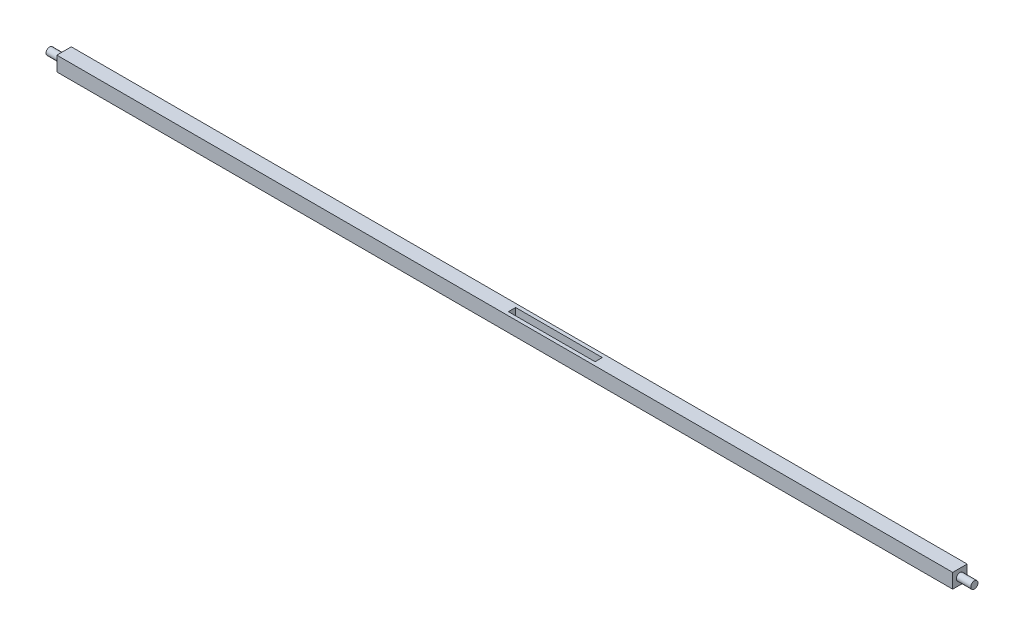
ISO-10303-21;
HEADER;
FILE_DESCRIPTION(('STEP AP214'),'2;1');
FILE_NAME('part.step','',(''),(''),'','','');
FILE_SCHEMA(('AUTOMOTIVE_DESIGN { 1 0 10303 214 1 1 1 1 }'));
ENDSEC;
DATA;
#1=APPLICATION_CONTEXT('core data for automotive mechanical design processes');
#2=APPLICATION_PROTOCOL_DEFINITION('international standard','automotive_design',2000,#1);
#3=PRODUCT_CONTEXT('',#1,'mechanical');
#4=PRODUCT('Part','Part','',(#3));
#5=PRODUCT_RELATED_PRODUCT_CATEGORY('part','',(#4));
#6=PRODUCT_DEFINITION_FORMATION('','',#4);
#7=PRODUCT_DEFINITION_CONTEXT('part definition',#1,'design');
#8=PRODUCT_DEFINITION('design','',#6,#7);
#9=PRODUCT_DEFINITION_SHAPE('','',#8);
#10=(LENGTH_UNIT() NAMED_UNIT(*) SI_UNIT(.MILLI.,.METRE.));
#11=(NAMED_UNIT(*) PLANE_ANGLE_UNIT() SI_UNIT($,.RADIAN.));
#12=(NAMED_UNIT(*) SI_UNIT($,.STERADIAN.) SOLID_ANGLE_UNIT());
#13=UNCERTAINTY_MEASURE_WITH_UNIT(LENGTH_MEASURE(1.E-05),#10,'distance_accuracy_value','');
#14=(GEOMETRIC_REPRESENTATION_CONTEXT(3) GLOBAL_UNCERTAINTY_ASSIGNED_CONTEXT((#13)) GLOBAL_UNIT_ASSIGNED_CONTEXT((#10,
#11,#12)) REPRESENTATION_CONTEXT('',''));
#15=CARTESIAN_POINT('',(0.,0.,0.));
#16=DIRECTION('',(0.,0.,1.));
#17=DIRECTION('',(1.,0.,0.));
#18=AXIS2_PLACEMENT_3D('',#15,#16,#17);
#19=CARTESIAN_POINT('',(406.4,-6.41066878980892,-6.35));
#20=DIRECTION('',(0.,0.,1.));
#21=DIRECTION('',(1.,0.,0.));
#22=AXIS2_PLACEMENT_3D('',#19,#20,#21);
#23=PLANE('',#22);
#24=DIRECTION('',(0.,1.,0.));
#25=VECTOR('',#24,1.);
#26=CARTESIAN_POINT('',(-393.7,0.,-6.35));
#27=LINE('',#26,#25);
#28=CARTESIAN_POINT('',(-393.7,-6.41066878980892,-6.35));
#29=VERTEX_POINT('',#28);
#30=CARTESIAN_POINT('',(-393.7,6.41066878980892,-6.35));
#31=VERTEX_POINT('',#30);
#32=EDGE_CURVE('E205',#29,#31,#27,.T.);
#33=ORIENTED_EDGE('',*,*,#32,.T.);
#34=DIRECTION('',(-1.,0.,0.));
#35=VECTOR('',#34,1.);
#36=CARTESIAN_POINT('',(406.4,6.41066878980892,-6.35));
#37=LINE('',#36,#35);
#38=CARTESIAN_POINT('',(393.7,6.41066878980892,-6.35));
#39=VERTEX_POINT('',#38);
#40=EDGE_CURVE('E12',#39,#31,#37,.T.);
#41=ORIENTED_EDGE('',*,*,#40,.F.);
#42=DIRECTION('',(0.,1.,0.));
#43=VECTOR('',#42,1.);
#44=CARTESIAN_POINT('',(393.7,0.,-6.35));
#45=LINE('',#44,#43);
#46=CARTESIAN_POINT('',(393.7,-6.41066878980892,-6.35));
#47=VERTEX_POINT('',#46);
#48=EDGE_CURVE('E216',#47,#39,#45,.T.);
#49=ORIENTED_EDGE('',*,*,#48,.F.);
#50=DIRECTION('',(-1.,0.,0.));
#51=VECTOR('',#50,1.);
#52=CARTESIAN_POINT('',(406.4,-6.41066878980892,-6.35));
#53=LINE('',#52,#51);
#54=EDGE_CURVE('E224',#47,#29,#53,.T.);
#55=ORIENTED_EDGE('',*,*,#54,.T.);
#56=EDGE_LOOP('',(#33,#41,#49,#55));
#57=FACE_BOUND('',#56,.T.);
#58=ADVANCED_FACE('F94',(#57),#23,.F.);
#59=CARTESIAN_POINT('',(406.4,6.41066878980892,6.35));
#60=DIRECTION('',(0.,-1.,0.));
#61=DIRECTION('',(0.,0.,-1.));
#62=AXIS2_PLACEMENT_3D('',#59,#60,#61);
#63=PLANE('',#62);
#64=DIRECTION('',(1.,0.,0.));
#65=VECTOR('',#64,1.);
#66=CARTESIAN_POINT('',(0.,6.41066878980892,3.175));
#67=LINE('',#66,#65);
#68=CARTESIAN_POINT('',(0.,6.41066878980892,3.175));
#69=VERTEX_POINT('',#68);
#70=CARTESIAN_POINT('',(76.2,6.41066878980892,3.175));
#71=VERTEX_POINT('',#70);
#72=EDGE_CURVE('E180',#69,#71,#67,.T.);
#73=ORIENTED_EDGE('',*,*,#72,.F.);
#74=DIRECTION('',(0.,0.,1.));
#75=VECTOR('',#74,1.);
#76=CARTESIAN_POINT('',(0.,6.41066878980892,-3.175));
#77=LINE('',#76,#75);
#78=CARTESIAN_POINT('',(0.,6.41066878980892,-3.175));
#79=VERTEX_POINT('',#78);
#80=EDGE_CURVE('E108',#79,#69,#77,.T.);
#81=ORIENTED_EDGE('',*,*,#80,.F.);
#82=DIRECTION('',(-1.,0.,0.));
#83=VECTOR('',#82,1.);
#84=CARTESIAN_POINT('',(0.,6.41066878980892,-3.175));
#85=LINE('',#84,#83);
#86=CARTESIAN_POINT('',(76.2,6.41066878980892,-3.175));
#87=VERTEX_POINT('',#86);
#88=EDGE_CURVE('E166',#87,#79,#85,.T.);
#89=ORIENTED_EDGE('',*,*,#88,.F.);
#90=DIRECTION('',(0.,0.,-1.));
#91=VECTOR('',#90,1.);
#92=CARTESIAN_POINT('',(76.2,6.41066878980892,-3.175));
#93=LINE('',#92,#91);
#94=EDGE_CURVE('E186',#71,#87,#93,.T.);
#95=ORIENTED_EDGE('',*,*,#94,.F.);
#96=EDGE_LOOP('',(#73,#81,#89,#95));
#97=FACE_BOUND('',#96,.T.);
#98=DIRECTION('',(0.,0.,1.));
#99=VECTOR('',#98,1.);
#100=CARTESIAN_POINT('',(-393.7,6.41066878980892,0.));
#101=LINE('',#100,#99);
#102=CARTESIAN_POINT('',(-393.7,6.41066878980892,6.35));
#103=VERTEX_POINT('',#102);
#104=EDGE_CURVE('E202',#31,#103,#101,.T.);
#105=ORIENTED_EDGE('',*,*,#104,.T.);
#106=DIRECTION('',(-1.,0.,0.));
#107=VECTOR('',#106,1.);
#108=CARTESIAN_POINT('',(406.4,6.41066878980892,6.35));
#109=LINE('',#108,#107);
#110=CARTESIAN_POINT('',(393.7,6.41066878980892,6.35));
#111=VERTEX_POINT('',#110);
#112=EDGE_CURVE('E101',#111,#103,#109,.T.);
#113=ORIENTED_EDGE('',*,*,#112,.F.);
#114=DIRECTION('',(0.,0.,-1.));
#115=VECTOR('',#114,1.);
#116=CARTESIAN_POINT('',(393.7,6.41066878980892,0.));
#117=LINE('',#116,#115);
#118=EDGE_CURVE('E218',#111,#39,#117,.T.);
#119=ORIENTED_EDGE('',*,*,#118,.T.);
#120=ORIENTED_EDGE('',*,*,#40,.T.);
#121=EDGE_LOOP('',(#105,#113,#119,#120));
#122=FACE_BOUND('',#121,.T.);
#123=ADVANCED_FACE('F238',(#97,#122),#63,.F.);
#124=CARTESIAN_POINT('',(406.4,-6.41066878980892,6.35));
#125=DIRECTION('',(0.,0.,-1.));
#126=DIRECTION('',(-1.,0.,0.));
#127=AXIS2_PLACEMENT_3D('',#124,#125,#126);
#128=PLANE('',#127);
#129=DIRECTION('',(0.,1.,0.));
#130=VECTOR('',#129,1.);
#131=CARTESIAN_POINT('',(-393.7,0.,6.35));
#132=LINE('',#131,#130);
#133=CARTESIAN_POINT('',(-393.7,-6.41066878980892,6.35));
#134=VERTEX_POINT('',#133);
#135=EDGE_CURVE('E200',#134,#103,#132,.T.);
#136=ORIENTED_EDGE('',*,*,#135,.F.);
#137=DIRECTION('',(-1.,0.,0.));
#138=VECTOR('',#137,1.);
#139=CARTESIAN_POINT('',(406.4,-6.41066878980892,6.35));
#140=LINE('',#139,#138);
#141=CARTESIAN_POINT('',(393.7,-6.41066878980892,6.35));
#142=VERTEX_POINT('',#141);
#143=EDGE_CURVE('E229',#142,#134,#140,.T.);
#144=ORIENTED_EDGE('',*,*,#143,.F.);
#145=DIRECTION('',(0.,1.,0.));
#146=VECTOR('',#145,1.);
#147=CARTESIAN_POINT('',(393.7,0.,6.35));
#148=LINE('',#147,#146);
#149=EDGE_CURVE('E221',#142,#111,#148,.T.);
#150=ORIENTED_EDGE('',*,*,#149,.T.);
#151=ORIENTED_EDGE('',*,*,#112,.T.);
#152=EDGE_LOOP('',(#136,#144,#150,#151));
#153=FACE_BOUND('',#152,.T.);
#154=ADVANCED_FACE('F235',(#153),#128,.F.);
#155=CARTESIAN_POINT('',(406.4,-6.41066878980892,6.35));
#156=DIRECTION('',(0.,1.,0.));
#157=DIRECTION('',(0.,0.,1.));
#158=AXIS2_PLACEMENT_3D('',#155,#156,#157);
#159=PLANE('',#158);
#160=DIRECTION('',(1.,0.,0.));
#161=VECTOR('',#160,1.);
#162=CARTESIAN_POINT('',(0.,-6.41066878980892,-3.175));
#163=LINE('',#162,#161);
#164=CARTESIAN_POINT('',(0.,-6.41066878980892,-3.175));
#165=VERTEX_POINT('',#164);
#166=CARTESIAN_POINT('',(76.2,-6.41066878980892,-3.175));
#167=VERTEX_POINT('',#166);
#168=EDGE_CURVE('E178',#165,#167,#163,.T.);
#169=ORIENTED_EDGE('',*,*,#168,.F.);
#170=DIRECTION('',(0.,0.,-1.));
#171=VECTOR('',#170,1.);
#172=CARTESIAN_POINT('',(0.,-6.41066878980892,-3.175));
#173=LINE('',#172,#171);
#174=CARTESIAN_POINT('',(0.,-6.41066878980892,3.175));
#175=VERTEX_POINT('',#174);
#176=EDGE_CURVE('E160',#175,#165,#173,.T.);
#177=ORIENTED_EDGE('',*,*,#176,.F.);
#178=DIRECTION('',(-1.,0.,0.));
#179=VECTOR('',#178,1.);
#180=CARTESIAN_POINT('',(0.,-6.41066878980892,3.175));
#181=LINE('',#180,#179);
#182=CARTESIAN_POINT('',(76.2,-6.41066878980892,3.175));
#183=VERTEX_POINT('',#182);
#184=EDGE_CURVE('E169',#183,#175,#181,.T.);
#185=ORIENTED_EDGE('',*,*,#184,.F.);
#186=DIRECTION('',(0.,0.,1.));
#187=VECTOR('',#186,1.);
#188=CARTESIAN_POINT('',(76.2,-6.41066878980892,-3.175));
#189=LINE('',#188,#187);
#190=EDGE_CURVE('E116',#167,#183,#189,.T.);
#191=ORIENTED_EDGE('',*,*,#190,.F.);
#192=EDGE_LOOP('',(#169,#177,#185,#191));
#193=FACE_BOUND('',#192,.T.);
#194=DIRECTION('',(0.,0.,1.));
#195=VECTOR('',#194,1.);
#196=CARTESIAN_POINT('',(-393.7,-6.41066878980892,0.));
#197=LINE('',#196,#195);
#198=EDGE_CURVE('E198',#29,#134,#197,.T.);
#199=ORIENTED_EDGE('',*,*,#198,.F.);
#200=ORIENTED_EDGE('',*,*,#54,.F.);
#201=DIRECTION('',(0.,0.,-1.));
#202=VECTOR('',#201,1.);
#203=CARTESIAN_POINT('',(393.7,-6.41066878980892,0.));
#204=LINE('',#203,#202);
#205=EDGE_CURVE('E214',#142,#47,#204,.T.);
#206=ORIENTED_EDGE('',*,*,#205,.F.);
#207=ORIENTED_EDGE('',*,*,#143,.T.);
#208=EDGE_LOOP('',(#199,#200,#206,#207));
#209=FACE_BOUND('',#208,.T.);
#210=ADVANCED_FACE('F175',(#193,#209),#159,.F.);
#211=CARTESIAN_POINT('',(393.7,0.,0.));
#212=DIRECTION('',(1.,0.,0.));
#213=DIRECTION('',(0.,0.,-1.));
#214=AXIS2_PLACEMENT_3D('',#211,#212,#213);
#215=CYLINDRICAL_SURFACE('',#214,3.175);
#216=CARTESIAN_POINT('',(393.7,0.,0.));
#217=DIRECTION('',(1.,0.,0.));
#218=DIRECTION('',(0.,0.,-1.));
#219=AXIS2_PLACEMENT_3D('',#216,#217,#218);
#220=CIRCLE('',#219,3.175);
#221=CARTESIAN_POINT('',(393.7,0.,-3.175));
#222=VERTEX_POINT('',#221);
#223=EDGE_CURVE('E211',#222,#222,#220,.T.);
#224=ORIENTED_EDGE('',*,*,#223,.T.);
#225=EDGE_LOOP('',(#224));
#226=FACE_BOUND('',#225,.T.);
#227=CARTESIAN_POINT('',(406.4,0.,0.));
#228=DIRECTION('',(1.,0.,0.));
#229=DIRECTION('',(0.,0.,-1.));
#230=AXIS2_PLACEMENT_3D('',#227,#228,#229);
#231=CIRCLE('',#230,3.175);
#232=CARTESIAN_POINT('',(406.4,0.,-3.175));
#233=VERTEX_POINT('',#232);
#234=EDGE_CURVE('E208',#233,#233,#231,.T.);
#235=ORIENTED_EDGE('',*,*,#234,.F.);
#236=EDGE_LOOP('',(#235));
#237=FACE_BOUND('',#236,.T.);
#238=ADVANCED_FACE('F251',(#226,#237),#215,.T.);
#239=CARTESIAN_POINT('',(393.7,0.,0.));
#240=DIRECTION('',(1.,0.,0.));
#241=DIRECTION('',(0.,0.,-1.));
#242=AXIS2_PLACEMENT_3D('',#239,#240,#241);
#243=PLANE('',#242);
#244=ORIENTED_EDGE('',*,*,#223,.F.);
#245=EDGE_LOOP('',(#244));
#246=FACE_BOUND('',#245,.T.);
#247=ORIENTED_EDGE('',*,*,#205,.T.);
#248=ORIENTED_EDGE('',*,*,#48,.T.);
#249=ORIENTED_EDGE('',*,*,#118,.F.);
#250=ORIENTED_EDGE('',*,*,#149,.F.);
#251=EDGE_LOOP('',(#247,#248,#249,#250));
#252=FACE_BOUND('',#251,.T.);
#253=ADVANCED_FACE('F248',(#246,#252),#243,.T.);
#254=CARTESIAN_POINT('',(406.4,0.,0.));
#255=DIRECTION('',(-1.,0.,0.));
#256=DIRECTION('',(0.,0.,1.));
#257=AXIS2_PLACEMENT_3D('',#254,#255,#256);
#258=PLANE('',#257);
#259=ORIENTED_EDGE('',*,*,#234,.T.);
#260=EDGE_LOOP('',(#259));
#261=FACE_BOUND('',#260,.T.);
#262=ADVANCED_FACE('F250',(#261),#258,.F.);
#263=CARTESIAN_POINT('',(-393.7,0.,0.));
#264=DIRECTION('',(-1.,0.,0.));
#265=DIRECTION('',(0.,0.,1.));
#266=AXIS2_PLACEMENT_3D('',#263,#264,#265);
#267=CYLINDRICAL_SURFACE('',#266,3.175);
#268=CARTESIAN_POINT('',(-393.7,0.,0.));
#269=DIRECTION('',(-1.,0.,0.));
#270=DIRECTION('',(0.,0.,1.));
#271=AXIS2_PLACEMENT_3D('',#268,#269,#270);
#272=CIRCLE('',#271,3.175);
#273=CARTESIAN_POINT('',(-393.7,0.,3.175));
#274=VERTEX_POINT('',#273);
#275=EDGE_CURVE('E195',#274,#274,#272,.T.);
#276=ORIENTED_EDGE('',*,*,#275,.T.);
#277=EDGE_LOOP('',(#276));
#278=FACE_BOUND('',#277,.T.);
#279=CARTESIAN_POINT('',(-406.4,0.,0.));
#280=DIRECTION('',(-1.,0.,0.));
#281=DIRECTION('',(0.,0.,1.));
#282=AXIS2_PLACEMENT_3D('',#279,#280,#281);
#283=CIRCLE('',#282,3.175);
#284=CARTESIAN_POINT('',(-406.4,0.,3.175));
#285=VERTEX_POINT('',#284);
#286=EDGE_CURVE('E172',#285,#285,#283,.T.);
#287=ORIENTED_EDGE('',*,*,#286,.F.);
#288=EDGE_LOOP('',(#287));
#289=FACE_BOUND('',#288,.T.);
#290=ADVANCED_FACE('F258',(#278,#289),#267,.T.);
#291=CARTESIAN_POINT('',(-393.7,0.,0.));
#292=DIRECTION('',(-1.,0.,0.));
#293=DIRECTION('',(0.,0.,1.));
#294=AXIS2_PLACEMENT_3D('',#291,#292,#293);
#295=PLANE('',#294);
#296=ORIENTED_EDGE('',*,*,#275,.F.);
#297=EDGE_LOOP('',(#296));
#298=FACE_BOUND('',#297,.T.);
#299=ORIENTED_EDGE('',*,*,#198,.T.);
#300=ORIENTED_EDGE('',*,*,#135,.T.);
#301=ORIENTED_EDGE('',*,*,#104,.F.);
#302=ORIENTED_EDGE('',*,*,#32,.F.);
#303=EDGE_LOOP('',(#299,#300,#301,#302));
#304=FACE_BOUND('',#303,.T.);
#305=ADVANCED_FACE('F241',(#298,#304),#295,.T.);
#306=CARTESIAN_POINT('',(-406.4,0.,0.));
#307=DIRECTION('',(-1.,0.,0.));
#308=DIRECTION('',(0.,0.,1.));
#309=AXIS2_PLACEMENT_3D('',#306,#307,#308);
#310=PLANE('',#309);
#311=ORIENTED_EDGE('',*,*,#286,.T.);
#312=EDGE_LOOP('',(#311));
#313=FACE_BOUND('',#312,.T.);
#314=ADVANCED_FACE('F277',(#313),#310,.T.);
#315=CARTESIAN_POINT('',(0.,-6.41166878980892,-3.175));
#316=DIRECTION('',(-1.,0.,0.));
#317=DIRECTION('',(0.,0.,1.));
#318=AXIS2_PLACEMENT_3D('',#315,#316,#317);
#319=PLANE('',#318);
#320=ORIENTED_EDGE('',*,*,#176,.T.);
#321=DIRECTION('',(0.,1.,0.));
#322=VECTOR('',#321,1.);
#323=CARTESIAN_POINT('',(0.,-6.41166878980892,-3.175));
#324=LINE('',#323,#322);
#325=EDGE_CURVE('E173',#165,#79,#324,.T.);
#326=ORIENTED_EDGE('',*,*,#325,.T.);
#327=ORIENTED_EDGE('',*,*,#80,.T.);
#328=DIRECTION('',(0.,1.,0.));
#329=VECTOR('',#328,1.);
#330=CARTESIAN_POINT('',(0.,-6.41166878980892,3.175));
#331=LINE('',#330,#329);
#332=EDGE_CURVE('E156',#175,#69,#331,.T.);
#333=ORIENTED_EDGE('',*,*,#332,.F.);
#334=EDGE_LOOP('',(#320,#326,#327,#333));
#335=FACE_BOUND('',#334,.T.);
#336=ADVANCED_FACE('F158',(#335),#319,.F.);
#337=CARTESIAN_POINT('',(0.,-6.41166878980892,-3.175));
#338=DIRECTION('',(0.,0.,-1.));
#339=DIRECTION('',(-1.,0.,0.));
#340=AXIS2_PLACEMENT_3D('',#337,#338,#339);
#341=PLANE('',#340);
#342=ORIENTED_EDGE('',*,*,#168,.T.);
#343=DIRECTION('',(0.,1.,0.));
#344=VECTOR('',#343,1.);
#345=CARTESIAN_POINT('',(76.2,-6.41166878980892,-3.175));
#346=LINE('',#345,#344);
#347=EDGE_CURVE('E192',#167,#87,#346,.T.);
#348=ORIENTED_EDGE('',*,*,#347,.T.);
#349=ORIENTED_EDGE('',*,*,#88,.T.);
#350=ORIENTED_EDGE('',*,*,#325,.F.);
#351=EDGE_LOOP('',(#342,#348,#349,#350));
#352=FACE_BOUND('',#351,.T.);
#353=ADVANCED_FACE('F284',(#352),#341,.F.);
#354=CARTESIAN_POINT('',(76.2,-6.41166878980892,-3.175));
#355=DIRECTION('',(1.,0.,0.));
#356=DIRECTION('',(0.,0.,-1.));
#357=AXIS2_PLACEMENT_3D('',#354,#355,#356);
#358=PLANE('',#357);
#359=ORIENTED_EDGE('',*,*,#190,.T.);
#360=DIRECTION('',(0.,1.,0.));
#361=VECTOR('',#360,1.);
#362=CARTESIAN_POINT('',(76.2,-6.41166878980892,3.175));
#363=LINE('',#362,#361);
#364=EDGE_CURVE('E165',#183,#71,#363,.T.);
#365=ORIENTED_EDGE('',*,*,#364,.T.);
#366=ORIENTED_EDGE('',*,*,#94,.T.);
#367=ORIENTED_EDGE('',*,*,#347,.F.);
#368=EDGE_LOOP('',(#359,#365,#366,#367));
#369=FACE_BOUND('',#368,.T.);
#370=ADVANCED_FACE('F297',(#369),#358,.F.);
#371=CARTESIAN_POINT('',(0.,-6.41166878980892,3.175));
#372=DIRECTION('',(0.,0.,1.));
#373=DIRECTION('',(1.,0.,0.));
#374=AXIS2_PLACEMENT_3D('',#371,#372,#373);
#375=PLANE('',#374);
#376=ORIENTED_EDGE('',*,*,#184,.T.);
#377=ORIENTED_EDGE('',*,*,#332,.T.);
#378=ORIENTED_EDGE('',*,*,#72,.T.);
#379=ORIENTED_EDGE('',*,*,#364,.F.);
#380=EDGE_LOOP('',(#376,#377,#378,#379));
#381=FACE_BOUND('',#380,.T.);
#382=ADVANCED_FACE('F170',(#381),#375,.F.);
#383=CLOSED_SHELL('',(#58,#123,#154,#210,#238,#253,#262,#290,#305,#314,#336,#353,#370,#382));
#384=MANIFOLD_SOLID_BREP('B2',#383);
#385=ADVANCED_BREP_SHAPE_REPRESENTATION('',(#18,#384),#14);
#386=SHAPE_DEFINITION_REPRESENTATION(#9,#385);
ENDSEC;
END-ISO-10303-21;
